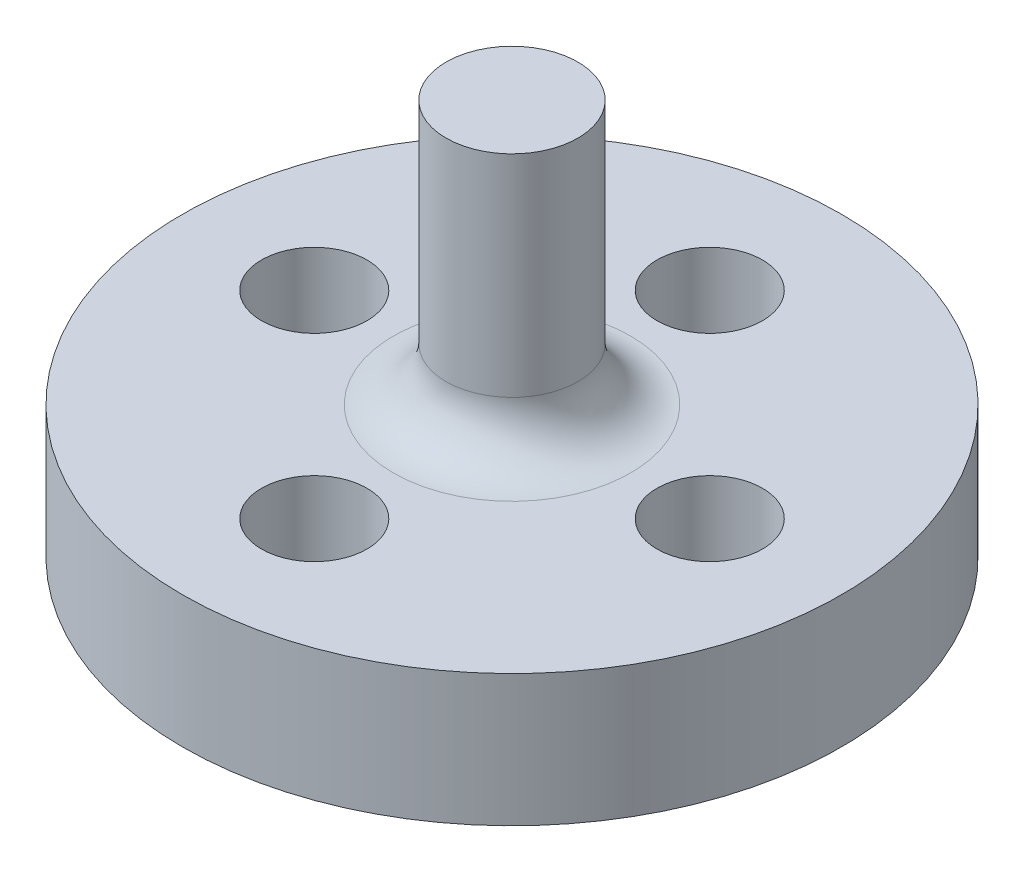
ISO-10303-21;
HEADER;
FILE_DESCRIPTION(('STEP AP214'),'2;1');
FILE_NAME('part.step','',(''),(''),'','','');
FILE_SCHEMA(('AUTOMOTIVE_DESIGN { 1 0 10303 214 1 1 1 1 }'));
ENDSEC;
DATA;
#1=APPLICATION_CONTEXT('core data for automotive mechanical design processes');
#2=APPLICATION_PROTOCOL_DEFINITION('international standard','automotive_design',2000,#1);
#3=PRODUCT_CONTEXT('',#1,'mechanical');
#4=PRODUCT('Part','Part','',(#3));
#5=PRODUCT_RELATED_PRODUCT_CATEGORY('part','',(#4));
#6=PRODUCT_DEFINITION_FORMATION('','',#4);
#7=PRODUCT_DEFINITION_CONTEXT('part definition',#1,'design');
#8=PRODUCT_DEFINITION('design','',#6,#7);
#9=PRODUCT_DEFINITION_SHAPE('','',#8);
#10=(LENGTH_UNIT() NAMED_UNIT(*) SI_UNIT(.MILLI.,.METRE.));
#11=(NAMED_UNIT(*) PLANE_ANGLE_UNIT() SI_UNIT($,.RADIAN.));
#12=(NAMED_UNIT(*) SI_UNIT($,.STERADIAN.) SOLID_ANGLE_UNIT());
#13=UNCERTAINTY_MEASURE_WITH_UNIT(LENGTH_MEASURE(1.E-05),#10,'distance_accuracy_value','');
#14=(GEOMETRIC_REPRESENTATION_CONTEXT(3) GLOBAL_UNCERTAINTY_ASSIGNED_CONTEXT((#13)) GLOBAL_UNIT_ASSIGNED_CONTEXT((#10,
#11,#12)) REPRESENTATION_CONTEXT('',''));
#15=CARTESIAN_POINT('',(0.,0.,0.));
#16=DIRECTION('',(0.,0.,1.));
#17=DIRECTION('',(1.,0.,0.));
#18=AXIS2_PLACEMENT_3D('',#15,#16,#17);
#19=CARTESIAN_POINT('',(-7.5,5.,0.));
#20=DIRECTION('',(0.,-1.,0.));
#21=DIRECTION('',(0.,0.,-1.));
#22=AXIS2_PLACEMENT_3D('',#19,#20,#21);
#23=CYLINDRICAL_SURFACE('',#22,2.);
#24=CARTESIAN_POINT('',(-7.5,5.,0.));
#25=DIRECTION('',(0.,1.,0.));
#26=DIRECTION('',(0.,0.,1.));
#27=AXIS2_PLACEMENT_3D('',#24,#25,#26);
#28=CIRCLE('',#27,2.);
#29=CARTESIAN_POINT('',(-7.5,5.,2.));
#30=VERTEX_POINT('',#29);
#31=EDGE_CURVE('E61',#30,#30,#28,.T.);
#32=ORIENTED_EDGE('',*,*,#31,.T.);
#33=EDGE_LOOP('',(#32));
#34=FACE_BOUND('',#33,.T.);
#35=CARTESIAN_POINT('',(-7.5,0.,0.));
#36=DIRECTION('',(0.,1.,0.));
#37=DIRECTION('',(0.,0.,1.));
#38=AXIS2_PLACEMENT_3D('',#35,#36,#37);
#39=CIRCLE('',#38,2.);
#40=CARTESIAN_POINT('',(-7.5,0.,2.));
#41=VERTEX_POINT('',#40);
#42=EDGE_CURVE('E69',#41,#41,#39,.T.);
#43=ORIENTED_EDGE('',*,*,#42,.F.);
#44=EDGE_LOOP('',(#43));
#45=FACE_BOUND('',#44,.T.);
#46=ADVANCED_FACE('F43',(#34,#45),#23,.F.);
#47=CARTESIAN_POINT('',(7.5,5.,0.));
#48=DIRECTION('',(0.,-1.,0.));
#49=DIRECTION('',(0.,0.,-1.));
#50=AXIS2_PLACEMENT_3D('',#47,#48,#49);
#51=CYLINDRICAL_SURFACE('',#50,2.);
#52=CARTESIAN_POINT('',(7.5,5.,0.));
#53=DIRECTION('',(0.,1.,0.));
#54=DIRECTION('',(0.,0.,1.));
#55=AXIS2_PLACEMENT_3D('',#52,#53,#54);
#56=CIRCLE('',#55,2.);
#57=CARTESIAN_POINT('',(7.5,5.,2.));
#58=VERTEX_POINT('',#57);
#59=EDGE_CURVE('E89',#58,#58,#56,.T.);
#60=ORIENTED_EDGE('',*,*,#59,.T.);
#61=EDGE_LOOP('',(#60));
#62=FACE_BOUND('',#61,.T.);
#63=CARTESIAN_POINT('',(7.5,0.,0.));
#64=DIRECTION('',(0.,1.,0.));
#65=DIRECTION('',(0.,0.,1.));
#66=AXIS2_PLACEMENT_3D('',#63,#64,#65);
#67=CIRCLE('',#66,2.);
#68=CARTESIAN_POINT('',(7.5,0.,2.));
#69=VERTEX_POINT('',#68);
#70=EDGE_CURVE('E73',#69,#69,#67,.T.);
#71=ORIENTED_EDGE('',*,*,#70,.F.);
#72=EDGE_LOOP('',(#71));
#73=FACE_BOUND('',#72,.T.);
#74=ADVANCED_FACE('F152',(#62,#73),#51,.F.);
#75=CARTESIAN_POINT('',(0.,5.,-7.5));
#76=DIRECTION('',(0.,-1.,0.));
#77=DIRECTION('',(0.,0.,-1.));
#78=AXIS2_PLACEMENT_3D('',#75,#76,#77);
#79=CYLINDRICAL_SURFACE('',#78,2.);
#80=CARTESIAN_POINT('',(0.,5.,-7.5));
#81=DIRECTION('',(0.,1.,0.));
#82=DIRECTION('',(0.,0.,1.));
#83=AXIS2_PLACEMENT_3D('',#80,#81,#82);
#84=CIRCLE('',#83,2.);
#85=CARTESIAN_POINT('',(0.,5.,-5.5));
#86=VERTEX_POINT('',#85);
#87=EDGE_CURVE('E93',#86,#86,#84,.T.);
#88=ORIENTED_EDGE('',*,*,#87,.T.);
#89=EDGE_LOOP('',(#88));
#90=FACE_BOUND('',#89,.T.);
#91=CARTESIAN_POINT('',(0.,0.,-7.5));
#92=DIRECTION('',(0.,1.,0.));
#93=DIRECTION('',(0.,0.,1.));
#94=AXIS2_PLACEMENT_3D('',#91,#92,#93);
#95=CIRCLE('',#94,2.);
#96=CARTESIAN_POINT('',(0.,0.,-5.5));
#97=VERTEX_POINT('',#96);
#98=EDGE_CURVE('E77',#97,#97,#95,.T.);
#99=ORIENTED_EDGE('',*,*,#98,.F.);
#100=EDGE_LOOP('',(#99));
#101=FACE_BOUND('',#100,.T.);
#102=ADVANCED_FACE('F147',(#90,#101),#79,.F.);
#103=CARTESIAN_POINT('',(0.,5.,7.5));
#104=DIRECTION('',(0.,-1.,0.));
#105=DIRECTION('',(0.,0.,-1.));
#106=AXIS2_PLACEMENT_3D('',#103,#104,#105);
#107=CYLINDRICAL_SURFACE('',#106,2.);
#108=CARTESIAN_POINT('',(0.,5.,7.5));
#109=DIRECTION('',(0.,1.,0.));
#110=DIRECTION('',(0.,0.,1.));
#111=AXIS2_PLACEMENT_3D('',#108,#109,#110);
#112=CIRCLE('',#111,2.);
#113=CARTESIAN_POINT('',(0.,5.,9.5));
#114=VERTEX_POINT('',#113);
#115=EDGE_CURVE('E68',#114,#114,#112,.T.);
#116=ORIENTED_EDGE('',*,*,#115,.T.);
#117=EDGE_LOOP('',(#116));
#118=FACE_BOUND('',#117,.T.);
#119=CARTESIAN_POINT('',(0.,0.,7.5));
#120=DIRECTION('',(0.,1.,0.));
#121=DIRECTION('',(0.,0.,1.));
#122=AXIS2_PLACEMENT_3D('',#119,#120,#121);
#123=CIRCLE('',#122,2.);
#124=CARTESIAN_POINT('',(0.,0.,9.5));
#125=VERTEX_POINT('',#124);
#126=EDGE_CURVE('E81',#125,#125,#123,.T.);
#127=ORIENTED_EDGE('',*,*,#126,.F.);
#128=EDGE_LOOP('',(#127));
#129=FACE_BOUND('',#128,.T.);
#130=ADVANCED_FACE('F139',(#118,#129),#107,.F.);
#131=CARTESIAN_POINT('',(0.,5.,0.));
#132=DIRECTION('',(0.,-1.,0.));
#133=DIRECTION('',(0.,0.,-1.));
#134=AXIS2_PLACEMENT_3D('',#131,#132,#133);
#135=CYLINDRICAL_SURFACE('',#134,12.5);
#136=CARTESIAN_POINT('',(0.,5.,0.));
#137=DIRECTION('',(0.,1.,0.));
#138=DIRECTION('',(0.,0.,1.));
#139=AXIS2_PLACEMENT_3D('',#136,#137,#138);
#140=CIRCLE('',#139,12.5);
#141=CARTESIAN_POINT('',(0.,5.,12.5));
#142=VERTEX_POINT('',#141);
#143=EDGE_CURVE('E56',#142,#142,#140,.T.);
#144=ORIENTED_EDGE('',*,*,#143,.F.);
#145=EDGE_LOOP('',(#144));
#146=FACE_BOUND('',#145,.T.);
#147=CARTESIAN_POINT('',(0.,0.,0.));
#148=DIRECTION('',(0.,1.,0.));
#149=DIRECTION('',(0.,0.,1.));
#150=AXIS2_PLACEMENT_3D('',#147,#148,#149);
#151=CIRCLE('',#150,12.5);
#152=CARTESIAN_POINT('',(0.,0.,12.5));
#153=VERTEX_POINT('',#152);
#154=EDGE_CURVE('E64',#153,#153,#151,.T.);
#155=ORIENTED_EDGE('',*,*,#154,.T.);
#156=EDGE_LOOP('',(#155));
#157=FACE_BOUND('',#156,.T.);
#158=ADVANCED_FACE('F137',(#146,#157),#135,.T.);
#159=CARTESIAN_POINT('',(0.,5.,0.));
#160=DIRECTION('',(0.,1.,0.));
#161=DIRECTION('',(0.,0.,1.));
#162=AXIS2_PLACEMENT_3D('',#159,#160,#161);
#163=PLANE('',#162);
#164=CARTESIAN_POINT('',(0.,5.,0.));
#165=DIRECTION('',(0.,1.,0.));
#166=DIRECTION('',(0.,0.,1.));
#167=AXIS2_PLACEMENT_3D('',#164,#165,#166);
#168=CIRCLE('',#167,4.5);
#169=CARTESIAN_POINT('',(0.,5.,4.5));
#170=VERTEX_POINT('',#169);
#171=EDGE_CURVE('E10',#170,#170,#168,.F.);
#172=ORIENTED_EDGE('',*,*,#171,.T.);
#173=EDGE_LOOP('',(#172));
#174=FACE_BOUND('',#173,.T.);
#175=ORIENTED_EDGE('',*,*,#115,.F.);
#176=EDGE_LOOP('',(#175));
#177=FACE_BOUND('',#176,.T.);
#178=ORIENTED_EDGE('',*,*,#87,.F.);
#179=EDGE_LOOP('',(#178));
#180=FACE_BOUND('',#179,.T.);
#181=ORIENTED_EDGE('',*,*,#59,.F.);
#182=EDGE_LOOP('',(#181));
#183=FACE_BOUND('',#182,.T.);
#184=ORIENTED_EDGE('',*,*,#31,.F.);
#185=EDGE_LOOP('',(#184));
#186=FACE_BOUND('',#185,.T.);
#187=ORIENTED_EDGE('',*,*,#143,.T.);
#188=EDGE_LOOP('',(#187));
#189=FACE_BOUND('',#188,.T.);
#190=ADVANCED_FACE('F125',(#174,#177,#180,#183,#186,#189),#163,.T.);
#191=CARTESIAN_POINT('',(0.,0.,0.));
#192=DIRECTION('',(0.,1.,0.));
#193=DIRECTION('',(0.,0.,1.));
#194=AXIS2_PLACEMENT_3D('',#191,#192,#193);
#195=PLANE('',#194);
#196=CARTESIAN_POINT('',(0.,0.,0.));
#197=DIRECTION('',(0.,-1.,0.));
#198=DIRECTION('',(0.,0.,-1.));
#199=AXIS2_PLACEMENT_3D('',#196,#197,#198);
#200=CIRCLE('',#199,5.);
#201=CARTESIAN_POINT('',(0.,0.,-5.));
#202=VERTEX_POINT('',#201);
#203=EDGE_CURVE('E104',#202,#202,#200,.T.);
#204=ORIENTED_EDGE('',*,*,#203,.F.);
#205=EDGE_LOOP('',(#204));
#206=FACE_BOUND('',#205,.T.);
#207=ORIENTED_EDGE('',*,*,#126,.T.);
#208=EDGE_LOOP('',(#207));
#209=FACE_BOUND('',#208,.T.);
#210=ORIENTED_EDGE('',*,*,#98,.T.);
#211=EDGE_LOOP('',(#210));
#212=FACE_BOUND('',#211,.T.);
#213=ORIENTED_EDGE('',*,*,#70,.T.);
#214=EDGE_LOOP('',(#213));
#215=FACE_BOUND('',#214,.T.);
#216=ORIENTED_EDGE('',*,*,#42,.T.);
#217=EDGE_LOOP('',(#216));
#218=FACE_BOUND('',#217,.T.);
#219=ORIENTED_EDGE('',*,*,#154,.F.);
#220=EDGE_LOOP('',(#219));
#221=FACE_BOUND('',#220,.T.);
#222=ADVANCED_FACE('F121',(#206,#209,#212,#215,#218,#221),#195,.F.);
#223=CARTESIAN_POINT('',(0.,15.,0.));
#224=DIRECTION('',(0.,-1.,0.));
#225=DIRECTION('',(0.,0.,-1.));
#226=AXIS2_PLACEMENT_3D('',#223,#224,#225);
#227=CYLINDRICAL_SURFACE('',#226,2.5);
#228=CARTESIAN_POINT('',(0.,7.,0.));
#229=DIRECTION('',(0.,1.,0.));
#230=DIRECTION('',(0.,0.,1.));
#231=AXIS2_PLACEMENT_3D('',#228,#229,#230);
#232=CIRCLE('',#231,2.5);
#233=CARTESIAN_POINT('',(0.,7.,2.5));
#234=VERTEX_POINT('',#233);
#235=EDGE_CURVE('E51',#234,#234,#232,.T.);
#236=ORIENTED_EDGE('',*,*,#235,.T.);
#237=EDGE_LOOP('',(#236));
#238=FACE_BOUND('',#237,.T.);
#239=CARTESIAN_POINT('',(0.,15.,0.));
#240=DIRECTION('',(0.,1.,0.));
#241=DIRECTION('',(0.,0.,1.));
#242=AXIS2_PLACEMENT_3D('',#239,#240,#241);
#243=CIRCLE('',#242,2.5);
#244=CARTESIAN_POINT('',(0.,15.,2.5));
#245=VERTEX_POINT('',#244);
#246=EDGE_CURVE('E84',#245,#245,#243,.T.);
#247=ORIENTED_EDGE('',*,*,#246,.F.);
#248=EDGE_LOOP('',(#247));
#249=FACE_BOUND('',#248,.T.);
#250=ADVANCED_FACE('F124',(#238,#249),#227,.T.);
#251=CARTESIAN_POINT('',(0.,15.,0.));
#252=DIRECTION('',(0.,1.,0.));
#253=DIRECTION('',(0.,0.,1.));
#254=AXIS2_PLACEMENT_3D('',#251,#252,#253);
#255=PLANE('',#254);
#256=ORIENTED_EDGE('',*,*,#246,.T.);
#257=EDGE_LOOP('',(#256));
#258=FACE_BOUND('',#257,.T.);
#259=ADVANCED_FACE('F117',(#258),#255,.T.);
#260=CARTESIAN_POINT('',(0.,2.,0.));
#261=DIRECTION('',(0.,-1.,0.));
#262=DIRECTION('',(0.,0.,-1.));
#263=AXIS2_PLACEMENT_3D('',#260,#261,#262);
#264=CYLINDRICAL_SURFACE('',#263,5.);
#265=CARTESIAN_POINT('',(0.,2.,0.));
#266=DIRECTION('',(0.,-1.,0.));
#267=DIRECTION('',(0.,0.,-1.));
#268=AXIS2_PLACEMENT_3D('',#265,#266,#267);
#269=CIRCLE('',#268,5.);
#270=CARTESIAN_POINT('',(0.,2.,-5.));
#271=VERTEX_POINT('',#270);
#272=EDGE_CURVE('E103',#271,#271,#269,.T.);
#273=ORIENTED_EDGE('',*,*,#272,.F.);
#274=EDGE_LOOP('',(#273));
#275=FACE_BOUND('',#274,.T.);
#276=ORIENTED_EDGE('',*,*,#203,.T.);
#277=EDGE_LOOP('',(#276));
#278=FACE_BOUND('',#277,.T.);
#279=ADVANCED_FACE('F114',(#275,#278),#264,.F.);
#280=CARTESIAN_POINT('',(0.,2.,0.));
#281=DIRECTION('',(0.,-1.,0.));
#282=DIRECTION('',(0.,0.,-1.));
#283=AXIS2_PLACEMENT_3D('',#280,#281,#282);
#284=PLANE('',#283);
#285=ORIENTED_EDGE('',*,*,#272,.T.);
#286=EDGE_LOOP('',(#285));
#287=FACE_BOUND('',#286,.T.);
#288=ADVANCED_FACE('F112',(#287),#284,.T.);
#289=CARTESIAN_POINT('',(0.,7.,0.));
#290=DIRECTION('',(0.,1.,0.));
#291=DIRECTION('',(0.,0.,1.));
#292=AXIS2_PLACEMENT_3D('',#289,#290,#291);
#293=TOROIDAL_SURFACE('',#292,4.5,2.);
#294=ORIENTED_EDGE('',*,*,#171,.F.);
#295=EDGE_LOOP('',(#294));
#296=FACE_BOUND('',#295,.T.);
#297=ORIENTED_EDGE('',*,*,#235,.F.);
#298=EDGE_LOOP('',(#297));
#299=FACE_BOUND('',#298,.T.);
#300=ADVANCED_FACE('F45',(#296,#299),#293,.F.);
#301=CLOSED_SHELL('',(#46,#74,#102,#130,#158,#190,#222,#250,#259,#279,#288,#300));
#302=MANIFOLD_SOLID_BREP('B2',#301);
#303=ADVANCED_BREP_SHAPE_REPRESENTATION('',(#18,#302),#14);
#304=SHAPE_DEFINITION_REPRESENTATION(#9,#303);
ENDSEC;
END-ISO-10303-21;
